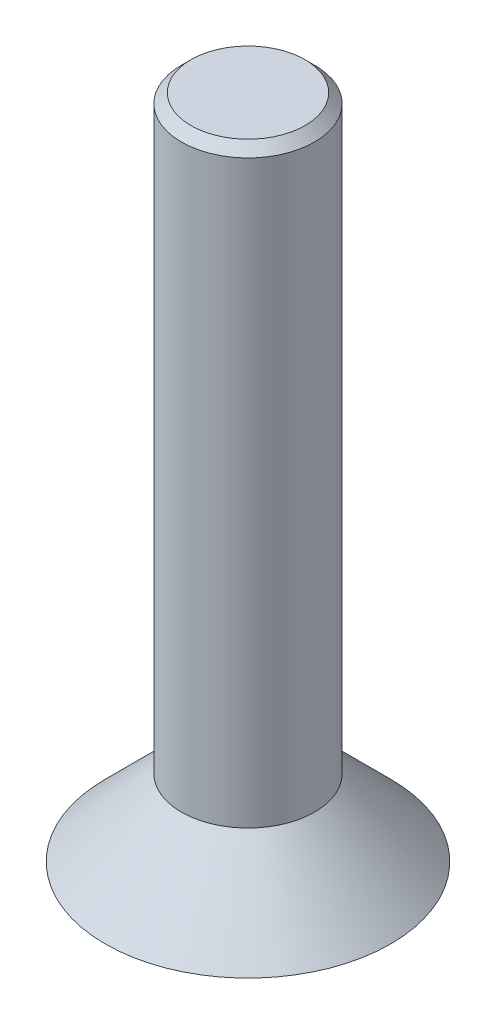
ISO-10303-21;
HEADER;
FILE_DESCRIPTION(('STEP AP214'),'2;1');
FILE_NAME('part.step','',(''),(''),'','','');
FILE_SCHEMA(('AUTOMOTIVE_DESIGN { 1 0 10303 214 1 1 1 1 }'));
ENDSEC;
DATA;
#1=APPLICATION_CONTEXT('core data for automotive mechanical design processes');
#2=APPLICATION_PROTOCOL_DEFINITION('international standard','automotive_design',2000,#1);
#3=PRODUCT_CONTEXT('',#1,'mechanical');
#4=PRODUCT('Part','Part','',(#3));
#5=PRODUCT_RELATED_PRODUCT_CATEGORY('part','',(#4));
#6=PRODUCT_DEFINITION_FORMATION('','',#4);
#7=PRODUCT_DEFINITION_CONTEXT('part definition',#1,'design');
#8=PRODUCT_DEFINITION('design','',#6,#7);
#9=PRODUCT_DEFINITION_SHAPE('','',#8);
#10=(LENGTH_UNIT() NAMED_UNIT(*) SI_UNIT(.MILLI.,.METRE.));
#11=(NAMED_UNIT(*) PLANE_ANGLE_UNIT() SI_UNIT($,.RADIAN.));
#12=(NAMED_UNIT(*) SI_UNIT($,.STERADIAN.) SOLID_ANGLE_UNIT());
#13=UNCERTAINTY_MEASURE_WITH_UNIT(LENGTH_MEASURE(1.E-05),#10,'distance_accuracy_value','');
#14=(GEOMETRIC_REPRESENTATION_CONTEXT(3) GLOBAL_UNCERTAINTY_ASSIGNED_CONTEXT((#13)) GLOBAL_UNIT_ASSIGNED_CONTEXT((#10,
#11,#12)) REPRESENTATION_CONTEXT('',''));
#15=CARTESIAN_POINT('',(0.,0.,0.));
#16=DIRECTION('',(0.,0.,1.));
#17=DIRECTION('',(1.,0.,0.));
#18=AXIS2_PLACEMENT_3D('',#15,#16,#17);
#19=CARTESIAN_POINT('',(0.,0.,0.));
#20=DIRECTION('',(0.,1.,0.));
#21=DIRECTION('',(0.,0.,1.));
#22=AXIS2_PLACEMENT_3D('',#19,#20,#21);
#23=PLANE('',#22);
#24=CARTESIAN_POINT('',(0.,0.,0.));
#25=DIRECTION('',(0.,1.,0.));
#26=DIRECTION('',(0.,0.,1.));
#27=AXIS2_PLACEMENT_3D('',#24,#25,#26);
#28=CIRCLE('',#27,3.);
#29=CARTESIAN_POINT('',(0.,0.,3.));
#30=VERTEX_POINT('',#29);
#31=EDGE_CURVE('E141',#30,#30,#28,.T.);
#32=ORIENTED_EDGE('',*,*,#31,.F.);
#33=EDGE_LOOP('',(#32));
#34=FACE_BOUND('',#33,.T.);
#35=DIRECTION('',(0.866025403784439,0.,0.5));
#36=VECTOR('',#35,1.);
#37=CARTESIAN_POINT('',(-1.,0.,0.577350269189626));
#38=LINE('',#37,#36);
#39=CARTESIAN_POINT('',(-1.,0.,0.577350269189626));
#40=VERTEX_POINT('',#39);
#41=CARTESIAN_POINT('',(0.,0.,1.15470053837925));
#42=VERTEX_POINT('',#41);
#43=EDGE_CURVE('E60',#40,#42,#38,.T.);
#44=ORIENTED_EDGE('',*,*,#43,.T.);
#45=DIRECTION('',(0.866025403784438,0.,-0.5));
#46=VECTOR('',#45,1.);
#47=CARTESIAN_POINT('',(0.,0.,1.15470053837925));
#48=LINE('',#47,#46);
#49=CARTESIAN_POINT('',(1.,0.,0.577350269189626));
#50=VERTEX_POINT('',#49);
#51=EDGE_CURVE('E120',#42,#50,#48,.T.);
#52=ORIENTED_EDGE('',*,*,#51,.T.);
#53=DIRECTION('',(0.,0.,-1.));
#54=VECTOR('',#53,1.);
#55=CARTESIAN_POINT('',(1.,0.,0.577350269189626));
#56=LINE('',#55,#54);
#57=CARTESIAN_POINT('',(0.999999999999999,0.,-0.577350269189626));
#58=VERTEX_POINT('',#57);
#59=EDGE_CURVE('E116',#50,#58,#56,.T.);
#60=ORIENTED_EDGE('',*,*,#59,.T.);
#61=DIRECTION('',(-0.866025403784439,0.,-0.5));
#62=VECTOR('',#61,1.);
#63=CARTESIAN_POINT('',(0.999999999999999,0.,-0.577350269189626));
#64=LINE('',#63,#62);
#65=CARTESIAN_POINT('',(0.,0.,-1.15470053837925));
#66=VERTEX_POINT('',#65);
#67=EDGE_CURVE('E95',#58,#66,#64,.T.);
#68=ORIENTED_EDGE('',*,*,#67,.T.);
#69=DIRECTION('',(-0.866025403784438,0.,0.5));
#70=VECTOR('',#69,1.);
#71=CARTESIAN_POINT('',(0.,0.,-1.15470053837925));
#72=LINE('',#71,#70);
#73=CARTESIAN_POINT('',(-1.,0.,-0.577350269189625));
#74=VERTEX_POINT('',#73);
#75=EDGE_CURVE('E105',#66,#74,#72,.T.);
#76=ORIENTED_EDGE('',*,*,#75,.T.);
#77=DIRECTION('',(0.,0.,1.));
#78=VECTOR('',#77,1.);
#79=CARTESIAN_POINT('',(-1.,0.,-0.577350269189625));
#80=LINE('',#79,#78);
#81=EDGE_CURVE('E112',#74,#40,#80,.T.);
#82=ORIENTED_EDGE('',*,*,#81,.T.);
#83=EDGE_LOOP('',(#44,#52,#60,#68,#76,#82));
#84=FACE_BOUND('',#83,.T.);
#85=ADVANCED_FACE('F43',(#34,#84),#23,.F.);
#86=CARTESIAN_POINT('',(-1.,1.6,0.577350269189626));
#87=DIRECTION('',(0.5,0.,-0.866025403784439));
#88=DIRECTION('',(-0.866025403784439,0.,-0.5));
#89=AXIS2_PLACEMENT_3D('',#86,#87,#88);
#90=PLANE('',#89);
#91=ORIENTED_EDGE('',*,*,#43,.F.);
#92=DIRECTION('',(0.,-1.,0.));
#93=VECTOR('',#92,1.);
#94=CARTESIAN_POINT('',(-1.,1.6,0.577350269189626));
#95=LINE('',#94,#93);
#96=CARTESIAN_POINT('',(-1.,1.6,0.577350269189626));
#97=VERTEX_POINT('',#96);
#98=EDGE_CURVE('E127',#97,#40,#95,.T.);
#99=ORIENTED_EDGE('',*,*,#98,.F.);
#100=DIRECTION('',(0.866025403784439,0.,0.5));
#101=VECTOR('',#100,1.);
#102=CARTESIAN_POINT('',(-1.,1.6,0.577350269189626));
#103=LINE('',#102,#101);
#104=CARTESIAN_POINT('',(0.,1.6,1.15470053837925));
#105=VERTEX_POINT('',#104);
#106=EDGE_CURVE('E126',#97,#105,#103,.T.);
#107=ORIENTED_EDGE('',*,*,#106,.T.);
#108=DIRECTION('',(0.,-1.,0.));
#109=VECTOR('',#108,1.);
#110=CARTESIAN_POINT('',(0.,1.6,1.15470053837925));
#111=LINE('',#110,#109);
#112=EDGE_CURVE('E138',#105,#42,#111,.T.);
#113=ORIENTED_EDGE('',*,*,#112,.T.);
#114=EDGE_LOOP('',(#91,#99,#107,#113));
#115=FACE_BOUND('',#114,.T.);
#116=ADVANCED_FACE('F163',(#115),#90,.T.);
#117=CARTESIAN_POINT('',(0.,1.6,1.15470053837925));
#118=DIRECTION('',(-0.5,0.,-0.866025403784438));
#119=DIRECTION('',(-0.866025403784439,0.,0.5));
#120=AXIS2_PLACEMENT_3D('',#117,#118,#119);
#121=PLANE('',#120);
#122=ORIENTED_EDGE('',*,*,#51,.F.);
#123=ORIENTED_EDGE('',*,*,#112,.F.);
#124=DIRECTION('',(0.866025403784438,0.,-0.5));
#125=VECTOR('',#124,1.);
#126=CARTESIAN_POINT('',(0.,1.6,1.15470053837925));
#127=LINE('',#126,#125);
#128=CARTESIAN_POINT('',(1.,1.6,0.577350269189626));
#129=VERTEX_POINT('',#128);
#130=EDGE_CURVE('E228',#105,#129,#127,.T.);
#131=ORIENTED_EDGE('',*,*,#130,.T.);
#132=DIRECTION('',(0.,-1.,0.));
#133=VECTOR('',#132,1.);
#134=CARTESIAN_POINT('',(1.,1.6,0.577350269189626));
#135=LINE('',#134,#133);
#136=EDGE_CURVE('E135',#129,#50,#135,.T.);
#137=ORIENTED_EDGE('',*,*,#136,.T.);
#138=EDGE_LOOP('',(#122,#123,#131,#137));
#139=FACE_BOUND('',#138,.T.);
#140=ADVANCED_FACE('F169',(#139),#121,.T.);
#141=CARTESIAN_POINT('',(1.,1.6,0.577350269189626));
#142=DIRECTION('',(-1.,0.,0.));
#143=DIRECTION('',(0.,0.,1.));
#144=AXIS2_PLACEMENT_3D('',#141,#142,#143);
#145=PLANE('',#144);
#146=ORIENTED_EDGE('',*,*,#59,.F.);
#147=ORIENTED_EDGE('',*,*,#136,.F.);
#148=DIRECTION('',(0.,0.,-1.));
#149=VECTOR('',#148,1.);
#150=CARTESIAN_POINT('',(1.,1.6,0.577350269189626));
#151=LINE('',#150,#149);
#152=CARTESIAN_POINT('',(0.999999999999999,1.6,-0.577350269189626));
#153=VERTEX_POINT('',#152);
#154=EDGE_CURVE('E225',#129,#153,#151,.T.);
#155=ORIENTED_EDGE('',*,*,#154,.T.);
#156=DIRECTION('',(0.,-1.,0.));
#157=VECTOR('',#156,1.);
#158=CARTESIAN_POINT('',(0.999999999999999,1.6,-0.577350269189626));
#159=LINE('',#158,#157);
#160=EDGE_CURVE('E101',#153,#58,#159,.T.);
#161=ORIENTED_EDGE('',*,*,#160,.T.);
#162=EDGE_LOOP('',(#146,#147,#155,#161));
#163=FACE_BOUND('',#162,.T.);
#164=ADVANCED_FACE('F201',(#163),#145,.T.);
#165=CARTESIAN_POINT('',(0.999999999999999,1.6,-0.577350269189626));
#166=DIRECTION('',(-0.5,0.,0.866025403784439));
#167=DIRECTION('',(0.866025403784439,0.,0.5));
#168=AXIS2_PLACEMENT_3D('',#165,#166,#167);
#169=PLANE('',#168);
#170=ORIENTED_EDGE('',*,*,#67,.F.);
#171=ORIENTED_EDGE('',*,*,#160,.F.);
#172=DIRECTION('',(-0.866025403784439,0.,-0.5));
#173=VECTOR('',#172,1.);
#174=CARTESIAN_POINT('',(0.999999999999999,1.6,-0.577350269189626));
#175=LINE('',#174,#173);
#176=CARTESIAN_POINT('',(0.,1.6,-1.15470053837925));
#177=VERTEX_POINT('',#176);
#178=EDGE_CURVE('E69',#153,#177,#175,.T.);
#179=ORIENTED_EDGE('',*,*,#178,.T.);
#180=DIRECTION('',(0.,-1.,0.));
#181=VECTOR('',#180,1.);
#182=CARTESIAN_POINT('',(0.,1.6,-1.15470053837925));
#183=LINE('',#182,#181);
#184=EDGE_CURVE('E90',#177,#66,#183,.T.);
#185=ORIENTED_EDGE('',*,*,#184,.T.);
#186=EDGE_LOOP('',(#170,#171,#179,#185));
#187=FACE_BOUND('',#186,.T.);
#188=ADVANCED_FACE('F92',(#187),#169,.T.);
#189=CARTESIAN_POINT('',(0.,1.6,-1.15470053837925));
#190=DIRECTION('',(0.5,0.,0.866025403784438));
#191=DIRECTION('',(0.866025403784439,0.,-0.5));
#192=AXIS2_PLACEMENT_3D('',#189,#190,#191);
#193=PLANE('',#192);
#194=ORIENTED_EDGE('',*,*,#75,.F.);
#195=ORIENTED_EDGE('',*,*,#184,.F.);
#196=DIRECTION('',(-0.866025403784438,0.,0.5));
#197=VECTOR('',#196,1.);
#198=CARTESIAN_POINT('',(0.,1.6,-1.15470053837925));
#199=LINE('',#198,#197);
#200=CARTESIAN_POINT('',(-1.,1.6,-0.577350269189625));
#201=VERTEX_POINT('',#200);
#202=EDGE_CURVE('E220',#177,#201,#199,.T.);
#203=ORIENTED_EDGE('',*,*,#202,.T.);
#204=DIRECTION('',(0.,-1.,0.));
#205=VECTOR('',#204,1.);
#206=CARTESIAN_POINT('',(-1.,1.6,-0.577350269189625));
#207=LINE('',#206,#205);
#208=EDGE_CURVE('E102',#201,#74,#207,.T.);
#209=ORIENTED_EDGE('',*,*,#208,.T.);
#210=EDGE_LOOP('',(#194,#195,#203,#209));
#211=FACE_BOUND('',#210,.T.);
#212=ADVANCED_FACE('F106',(#211),#193,.T.);
#213=CARTESIAN_POINT('',(-1.,1.6,-0.577350269189625));
#214=DIRECTION('',(1.,0.,0.));
#215=DIRECTION('',(0.,0.,-1.));
#216=AXIS2_PLACEMENT_3D('',#213,#214,#215);
#217=PLANE('',#216);
#218=ORIENTED_EDGE('',*,*,#81,.F.);
#219=ORIENTED_EDGE('',*,*,#208,.F.);
#220=DIRECTION('',(0.,0.,1.));
#221=VECTOR('',#220,1.);
#222=CARTESIAN_POINT('',(-1.,1.6,-0.577350269189625));
#223=LINE('',#222,#221);
#224=EDGE_CURVE('E130',#201,#97,#223,.T.);
#225=ORIENTED_EDGE('',*,*,#224,.T.);
#226=ORIENTED_EDGE('',*,*,#98,.T.);
#227=EDGE_LOOP('',(#218,#219,#225,#226));
#228=FACE_BOUND('',#227,.T.);
#229=ADVANCED_FACE('F179',(#228),#217,.T.);
#230=CARTESIAN_POINT('',(0.,1.6,0.));
#231=DIRECTION('',(0.,-1.,0.));
#232=DIRECTION('',(0.,0.,-1.));
#233=AXIS2_PLACEMENT_3D('',#230,#231,#232);
#234=CONICAL_SURFACE('',#233,1.4,0.785398163397447);
#235=ORIENTED_EDGE('',*,*,#31,.T.);
#236=EDGE_LOOP('',(#235));
#237=FACE_BOUND('',#236,.T.);
#238=CARTESIAN_POINT('',(0.,1.6,0.));
#239=DIRECTION('',(0.,1.,0.));
#240=DIRECTION('',(0.,0.,1.));
#241=AXIS2_PLACEMENT_3D('',#238,#239,#240);
#242=CIRCLE('',#241,1.4);
#243=CARTESIAN_POINT('',(0.,1.6,1.4));
#244=VERTEX_POINT('',#243);
#245=EDGE_CURVE('E145',#244,#244,#242,.T.);
#246=ORIENTED_EDGE('',*,*,#245,.F.);
#247=EDGE_LOOP('',(#246));
#248=FACE_BOUND('',#247,.T.);
#249=ADVANCED_FACE('F174',(#237,#248),#234,.T.);
#250=CARTESIAN_POINT('',(0.,1.6,0.));
#251=DIRECTION('',(0.,1.,0.));
#252=DIRECTION('',(0.,0.,1.));
#253=AXIS2_PLACEMENT_3D('',#250,#251,#252);
#254=PLANE('',#253);
#255=ORIENTED_EDGE('',*,*,#130,.F.);
#256=ORIENTED_EDGE('',*,*,#106,.F.);
#257=ORIENTED_EDGE('',*,*,#224,.F.);
#258=ORIENTED_EDGE('',*,*,#202,.F.);
#259=ORIENTED_EDGE('',*,*,#178,.F.);
#260=ORIENTED_EDGE('',*,*,#154,.F.);
#261=EDGE_LOOP('',(#255,#256,#257,#258,#259,#260));
#262=FACE_BOUND('',#261,.T.);
#263=ADVANCED_FACE('F178',(#262),#254,.F.);
#264=CARTESIAN_POINT('',(0.,14.,0.));
#265=DIRECTION('',(0.,-1.,0.));
#266=DIRECTION('',(0.,0.,-1.));
#267=AXIS2_PLACEMENT_3D('',#264,#265,#266);
#268=CYLINDRICAL_SURFACE('',#267,1.4);
#269=CARTESIAN_POINT('',(0.,13.8,0.));
#270=DIRECTION('',(0.,1.,0.));
#271=DIRECTION('',(0.,0.,1.));
#272=AXIS2_PLACEMENT_3D('',#269,#270,#271);
#273=CIRCLE('',#272,1.4);
#274=CARTESIAN_POINT('',(0.,13.8,1.4));
#275=VERTEX_POINT('',#274);
#276=EDGE_CURVE('E11',#275,#275,#273,.F.);
#277=ORIENTED_EDGE('',*,*,#276,.T.);
#278=EDGE_LOOP('',(#277));
#279=FACE_BOUND('',#278,.T.);
#280=ORIENTED_EDGE('',*,*,#245,.T.);
#281=EDGE_LOOP('',(#280));
#282=FACE_BOUND('',#281,.T.);
#283=ADVANCED_FACE('F159',(#279,#282),#268,.T.);
#284=CARTESIAN_POINT('',(0.,14.,0.));
#285=DIRECTION('',(0.,1.,0.));
#286=DIRECTION('',(0.,0.,1.));
#287=AXIS2_PLACEMENT_3D('',#284,#285,#286);
#288=PLANE('',#287);
#289=CARTESIAN_POINT('',(0.,14.,0.));
#290=DIRECTION('',(0.,1.,0.));
#291=DIRECTION('',(0.,0.,1.));
#292=AXIS2_PLACEMENT_3D('',#289,#290,#291);
#293=CIRCLE('',#292,1.2);
#294=CARTESIAN_POINT('',(0.,14.,1.2));
#295=VERTEX_POINT('',#294);
#296=EDGE_CURVE('E53',#295,#295,#293,.T.);
#297=ORIENTED_EDGE('',*,*,#296,.T.);
#298=EDGE_LOOP('',(#297));
#299=FACE_BOUND('',#298,.T.);
#300=ADVANCED_FACE('F152',(#299),#288,.T.);
#301=CARTESIAN_POINT('',(0.,14.,0.));
#302=DIRECTION('',(0.,-1.,0.));
#303=DIRECTION('',(0.,0.,-1.));
#304=AXIS2_PLACEMENT_3D('',#301,#302,#303);
#305=CONICAL_SURFACE('',#304,1.2,0.785398163397444);
#306=ORIENTED_EDGE('',*,*,#276,.F.);
#307=EDGE_LOOP('',(#306));
#308=FACE_BOUND('',#307,.T.);
#309=ORIENTED_EDGE('',*,*,#296,.F.);
#310=EDGE_LOOP('',(#309));
#311=FACE_BOUND('',#310,.T.);
#312=ADVANCED_FACE('F46',(#308,#311),#305,.T.);
#313=CLOSED_SHELL('',(#85,#116,#140,#164,#188,#212,#229,#249,#263,#283,#300,#312));
#314=MANIFOLD_SOLID_BREP('B2',#313);
#315=ADVANCED_BREP_SHAPE_REPRESENTATION('',(#18,#314),#14);
#316=SHAPE_DEFINITION_REPRESENTATION(#9,#315);
ENDSEC;
END-ISO-10303-21;
